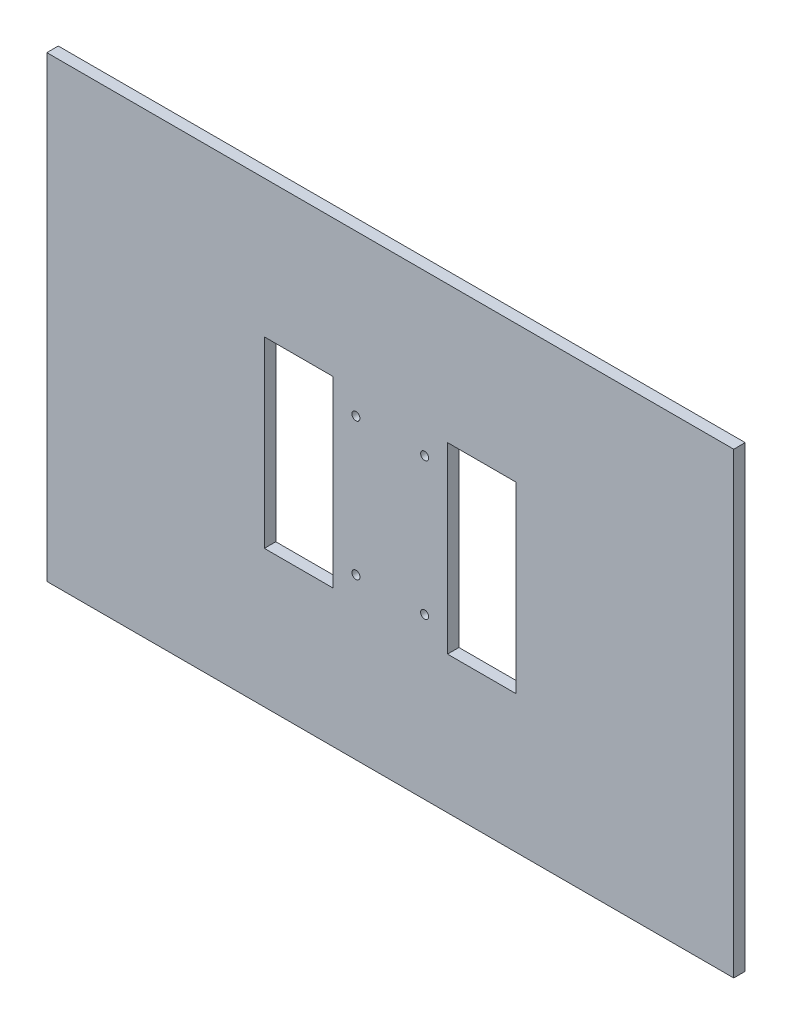
ISO-10303-21;
HEADER;
FILE_DESCRIPTION(('STEP AP214'),'2;1');
FILE_NAME('part.step','',(''),(''),'','','');
FILE_SCHEMA(('AUTOMOTIVE_DESIGN { 1 0 10303 214 1 1 1 1 }'));
ENDSEC;
DATA;
#1=APPLICATION_CONTEXT('core data for automotive mechanical design processes');
#2=APPLICATION_PROTOCOL_DEFINITION('international standard','automotive_design',2000,#1);
#3=PRODUCT_CONTEXT('',#1,'mechanical');
#4=PRODUCT('Part','Part','',(#3));
#5=PRODUCT_RELATED_PRODUCT_CATEGORY('part','',(#4));
#6=PRODUCT_DEFINITION_FORMATION('','',#4);
#7=PRODUCT_DEFINITION_CONTEXT('part definition',#1,'design');
#8=PRODUCT_DEFINITION('design','',#6,#7);
#9=PRODUCT_DEFINITION_SHAPE('','',#8);
#10=(LENGTH_UNIT() NAMED_UNIT(*) SI_UNIT(.MILLI.,.METRE.));
#11=(NAMED_UNIT(*) PLANE_ANGLE_UNIT() SI_UNIT($,.RADIAN.));
#12=(NAMED_UNIT(*) SI_UNIT($,.STERADIAN.) SOLID_ANGLE_UNIT());
#13=UNCERTAINTY_MEASURE_WITH_UNIT(LENGTH_MEASURE(1.E-05),#10,'distance_accuracy_value','');
#14=(GEOMETRIC_REPRESENTATION_CONTEXT(3) GLOBAL_UNCERTAINTY_ASSIGNED_CONTEXT((#13)) GLOBAL_UNIT_ASSIGNED_CONTEXT((#10,
#11,#12)) REPRESENTATION_CONTEXT('',''));
#15=CARTESIAN_POINT('',(0.,0.,0.));
#16=DIRECTION('',(0.,0.,1.));
#17=DIRECTION('',(1.,0.,0.));
#18=AXIS2_PLACEMENT_3D('',#15,#16,#17);
#19=CARTESIAN_POINT('',(150.,100.,5.));
#20=DIRECTION('',(-1.,0.,0.));
#21=DIRECTION('',(0.,-1.,0.));
#22=AXIS2_PLACEMENT_3D('',#19,#20,#21);
#23=PLANE('',#22);
#24=DIRECTION('',(0.,1.,0.));
#25=VECTOR('',#24,1.);
#26=CARTESIAN_POINT('',(150.,100.,0.));
#27=LINE('',#26,#25);
#28=CARTESIAN_POINT('',(150.,-100.,0.));
#29=VERTEX_POINT('',#28);
#30=CARTESIAN_POINT('',(150.,100.,0.));
#31=VERTEX_POINT('',#30);
#32=EDGE_CURVE('E210',#29,#31,#27,.T.);
#33=ORIENTED_EDGE('',*,*,#32,.T.);
#34=DIRECTION('',(0.,0.,-1.));
#35=VECTOR('',#34,1.);
#36=CARTESIAN_POINT('',(150.,100.,5.));
#37=LINE('',#36,#35);
#38=CARTESIAN_POINT('',(150.,100.,5.));
#39=VERTEX_POINT('',#38);
#40=EDGE_CURVE('E11',#39,#31,#37,.T.);
#41=ORIENTED_EDGE('',*,*,#40,.F.);
#42=DIRECTION('',(0.,1.,0.));
#43=VECTOR('',#42,1.);
#44=CARTESIAN_POINT('',(150.,100.,5.));
#45=LINE('',#44,#43);
#46=CARTESIAN_POINT('',(150.,-100.,5.));
#47=VERTEX_POINT('',#46);
#48=EDGE_CURVE('E213',#47,#39,#45,.T.);
#49=ORIENTED_EDGE('',*,*,#48,.F.);
#50=DIRECTION('',(0.,0.,-1.));
#51=VECTOR('',#50,1.);
#52=CARTESIAN_POINT('',(150.,-100.,5.));
#53=LINE('',#52,#51);
#54=EDGE_CURVE('E223',#47,#29,#53,.T.);
#55=ORIENTED_EDGE('',*,*,#54,.T.);
#56=EDGE_LOOP('',(#33,#41,#49,#55));
#57=FACE_BOUND('',#56,.T.);
#58=ADVANCED_FACE('F33',(#57),#23,.F.);
#59=CARTESIAN_POINT('',(-150.,100.,5.));
#60=DIRECTION('',(0.,-1.,0.));
#61=DIRECTION('',(0.,0.,-1.));
#62=AXIS2_PLACEMENT_3D('',#59,#60,#61);
#63=PLANE('',#62);
#64=DIRECTION('',(-1.,0.,0.));
#65=VECTOR('',#64,1.);
#66=CARTESIAN_POINT('',(-150.,100.,0.));
#67=LINE('',#66,#65);
#68=CARTESIAN_POINT('',(-150.,100.,0.));
#69=VERTEX_POINT('',#68);
#70=EDGE_CURVE('E226',#31,#69,#67,.T.);
#71=ORIENTED_EDGE('',*,*,#70,.T.);
#72=DIRECTION('',(0.,0.,-1.));
#73=VECTOR('',#72,1.);
#74=CARTESIAN_POINT('',(-150.,100.,5.));
#75=LINE('',#74,#73);
#76=CARTESIAN_POINT('',(-150.,100.,5.));
#77=VERTEX_POINT('',#76);
#78=EDGE_CURVE('E40',#77,#69,#75,.T.);
#79=ORIENTED_EDGE('',*,*,#78,.F.);
#80=DIRECTION('',(-1.,0.,0.));
#81=VECTOR('',#80,1.);
#82=CARTESIAN_POINT('',(-150.,100.,5.));
#83=LINE('',#82,#81);
#84=EDGE_CURVE('E216',#39,#77,#83,.T.);
#85=ORIENTED_EDGE('',*,*,#84,.F.);
#86=ORIENTED_EDGE('',*,*,#40,.T.);
#87=EDGE_LOOP('',(#71,#79,#85,#86));
#88=FACE_BOUND('',#87,.T.);
#89=ADVANCED_FACE('F255',(#88),#63,.F.);
#90=CARTESIAN_POINT('',(-150.,100.,5.));
#91=DIRECTION('',(1.,0.,0.));
#92=DIRECTION('',(0.,1.,0.));
#93=AXIS2_PLACEMENT_3D('',#90,#91,#92);
#94=PLANE('',#93);
#95=DIRECTION('',(0.,-1.,0.));
#96=VECTOR('',#95,1.);
#97=CARTESIAN_POINT('',(-150.,100.,0.));
#98=LINE('',#97,#96);
#99=CARTESIAN_POINT('',(-150.,-100.,0.));
#100=VERTEX_POINT('',#99);
#101=EDGE_CURVE('E228',#69,#100,#98,.T.);
#102=ORIENTED_EDGE('',*,*,#101,.T.);
#103=DIRECTION('',(0.,0.,-1.));
#104=VECTOR('',#103,1.);
#105=CARTESIAN_POINT('',(-150.,-100.,5.));
#106=LINE('',#105,#104);
#107=CARTESIAN_POINT('',(-150.,-100.,5.));
#108=VERTEX_POINT('',#107);
#109=EDGE_CURVE('E233',#108,#100,#106,.T.);
#110=ORIENTED_EDGE('',*,*,#109,.F.);
#111=DIRECTION('',(0.,-1.,0.));
#112=VECTOR('',#111,1.);
#113=CARTESIAN_POINT('',(-150.,100.,5.));
#114=LINE('',#113,#112);
#115=EDGE_CURVE('E219',#77,#108,#114,.T.);
#116=ORIENTED_EDGE('',*,*,#115,.F.);
#117=ORIENTED_EDGE('',*,*,#78,.T.);
#118=EDGE_LOOP('',(#102,#110,#116,#117));
#119=FACE_BOUND('',#118,.T.);
#120=ADVANCED_FACE('F240',(#119),#94,.F.);
#121=CARTESIAN_POINT('',(-150.,-100.,5.));
#122=DIRECTION('',(0.,1.,0.));
#123=DIRECTION('',(0.,0.,1.));
#124=AXIS2_PLACEMENT_3D('',#121,#122,#123);
#125=PLANE('',#124);
#126=DIRECTION('',(1.,0.,0.));
#127=VECTOR('',#126,1.);
#128=CARTESIAN_POINT('',(-150.,-100.,0.));
#129=LINE('',#128,#127);
#130=EDGE_CURVE('E217',#100,#29,#129,.T.);
#131=ORIENTED_EDGE('',*,*,#130,.T.);
#132=ORIENTED_EDGE('',*,*,#54,.F.);
#133=DIRECTION('',(1.,0.,0.));
#134=VECTOR('',#133,1.);
#135=CARTESIAN_POINT('',(-150.,-100.,5.));
#136=LINE('',#135,#134);
#137=EDGE_CURVE('E221',#108,#47,#136,.T.);
#138=ORIENTED_EDGE('',*,*,#137,.F.);
#139=ORIENTED_EDGE('',*,*,#109,.T.);
#140=EDGE_LOOP('',(#131,#132,#138,#139));
#141=FACE_BOUND('',#140,.T.);
#142=ADVANCED_FACE('F248',(#141),#125,.F.);
#143=CARTESIAN_POINT('',(0.,0.,5.));
#144=DIRECTION('',(0.,0.,1.));
#145=DIRECTION('',(1.,0.,0.));
#146=AXIS2_PLACEMENT_3D('',#143,#144,#145);
#147=PLANE('',#146);
#148=DIRECTION('',(0.,1.,0.));
#149=VECTOR('',#148,1.);
#150=CARTESIAN_POINT('',(55.,40.,5.));
#151=LINE('',#150,#149);
#152=CARTESIAN_POINT('',(55.,-40.,5.));
#153=VERTEX_POINT('',#152);
#154=CARTESIAN_POINT('',(55.,40.,5.));
#155=VERTEX_POINT('',#154);
#156=EDGE_CURVE('E47',#153,#155,#151,.T.);
#157=ORIENTED_EDGE('',*,*,#156,.F.);
#158=DIRECTION('',(1.,0.,0.));
#159=VECTOR('',#158,1.);
#160=CARTESIAN_POINT('',(55.,-40.,5.));
#161=LINE('',#160,#159);
#162=CARTESIAN_POINT('',(25.,-40.,5.));
#163=VERTEX_POINT('',#162);
#164=EDGE_CURVE('E182',#163,#153,#161,.T.);
#165=ORIENTED_EDGE('',*,*,#164,.F.);
#166=DIRECTION('',(0.,-1.,0.));
#167=VECTOR('',#166,1.);
#168=CARTESIAN_POINT('',(25.,40.,5.));
#169=LINE('',#168,#167);
#170=CARTESIAN_POINT('',(25.,40.,5.));
#171=VERTEX_POINT('',#170);
#172=EDGE_CURVE('E196',#171,#163,#169,.T.);
#173=ORIENTED_EDGE('',*,*,#172,.F.);
#174=DIRECTION('',(-1.,0.,0.));
#175=VECTOR('',#174,1.);
#176=CARTESIAN_POINT('',(55.,40.,5.));
#177=LINE('',#176,#175);
#178=EDGE_CURVE('E193',#155,#171,#177,.T.);
#179=ORIENTED_EDGE('',*,*,#178,.F.);
#180=EDGE_LOOP('',(#157,#165,#173,#179));
#181=FACE_BOUND('',#180,.T.);
#182=CARTESIAN_POINT('',(-15.,30.,5.));
#183=DIRECTION('',(0.,0.,1.));
#184=DIRECTION('',(1.,0.,0.));
#185=AXIS2_PLACEMENT_3D('',#182,#183,#184);
#186=CIRCLE('',#185,1.75);
#187=CARTESIAN_POINT('',(-13.25,30.,5.));
#188=VERTEX_POINT('',#187);
#189=EDGE_CURVE('E168',#188,#188,#186,.T.);
#190=ORIENTED_EDGE('',*,*,#189,.F.);
#191=EDGE_LOOP('',(#190));
#192=FACE_BOUND('',#191,.T.);
#193=CARTESIAN_POINT('',(-15.,-30.,5.));
#194=DIRECTION('',(0.,0.,1.));
#195=DIRECTION('',(1.,0.,0.));
#196=AXIS2_PLACEMENT_3D('',#193,#194,#195);
#197=CIRCLE('',#196,1.75);
#198=CARTESIAN_POINT('',(-13.25,-30.,5.));
#199=VERTEX_POINT('',#198);
#200=EDGE_CURVE('E174',#199,#199,#197,.T.);
#201=ORIENTED_EDGE('',*,*,#200,.F.);
#202=EDGE_LOOP('',(#201));
#203=FACE_BOUND('',#202,.T.);
#204=CARTESIAN_POINT('',(15.,-30.,5.));
#205=DIRECTION('',(0.,0.,1.));
#206=DIRECTION('',(1.,0.,0.));
#207=AXIS2_PLACEMENT_3D('',#204,#205,#206);
#208=CIRCLE('',#207,1.75);
#209=CARTESIAN_POINT('',(16.75,-30.,5.));
#210=VERTEX_POINT('',#209);
#211=EDGE_CURVE('E148',#210,#210,#208,.T.);
#212=ORIENTED_EDGE('',*,*,#211,.F.);
#213=EDGE_LOOP('',(#212));
#214=FACE_BOUND('',#213,.T.);
#215=DIRECTION('',(0.,1.,0.));
#216=VECTOR('',#215,1.);
#217=CARTESIAN_POINT('',(-25.,40.,5.));
#218=LINE('',#217,#216);
#219=CARTESIAN_POINT('',(-25.,-40.,5.));
#220=VERTEX_POINT('',#219);
#221=CARTESIAN_POINT('',(-25.,40.,5.));
#222=VERTEX_POINT('',#221);
#223=EDGE_CURVE('E55',#220,#222,#218,.T.);
#224=ORIENTED_EDGE('',*,*,#223,.F.);
#225=DIRECTION('',(1.,0.,0.));
#226=VECTOR('',#225,1.);
#227=CARTESIAN_POINT('',(-55.,-40.,5.));
#228=LINE('',#227,#226);
#229=CARTESIAN_POINT('',(-55.,-40.,5.));
#230=VERTEX_POINT('',#229);
#231=EDGE_CURVE('E142',#230,#220,#228,.T.);
#232=ORIENTED_EDGE('',*,*,#231,.F.);
#233=DIRECTION('',(0.,-1.,0.));
#234=VECTOR('',#233,1.);
#235=CARTESIAN_POINT('',(-55.,40.,5.));
#236=LINE('',#235,#234);
#237=CARTESIAN_POINT('',(-55.,40.,5.));
#238=VERTEX_POINT('',#237);
#239=EDGE_CURVE('E145',#238,#230,#236,.T.);
#240=ORIENTED_EDGE('',*,*,#239,.F.);
#241=DIRECTION('',(-1.,0.,0.));
#242=VECTOR('',#241,1.);
#243=CARTESIAN_POINT('',(-55.,40.,5.));
#244=LINE('',#243,#242);
#245=EDGE_CURVE('E154',#222,#238,#244,.T.);
#246=ORIENTED_EDGE('',*,*,#245,.F.);
#247=EDGE_LOOP('',(#224,#232,#240,#246));
#248=FACE_BOUND('',#247,.T.);
#249=CARTESIAN_POINT('',(15.,30.,5.));
#250=DIRECTION('',(0.,0.,1.));
#251=DIRECTION('',(1.,0.,0.));
#252=AXIS2_PLACEMENT_3D('',#249,#250,#251);
#253=CIRCLE('',#252,1.75);
#254=CARTESIAN_POINT('',(16.75,30.,5.));
#255=VERTEX_POINT('',#254);
#256=EDGE_CURVE('E167',#255,#255,#253,.T.);
#257=ORIENTED_EDGE('',*,*,#256,.F.);
#258=EDGE_LOOP('',(#257));
#259=FACE_BOUND('',#258,.T.);
#260=ORIENTED_EDGE('',*,*,#48,.T.);
#261=ORIENTED_EDGE('',*,*,#84,.T.);
#262=ORIENTED_EDGE('',*,*,#115,.T.);
#263=ORIENTED_EDGE('',*,*,#137,.T.);
#264=EDGE_LOOP('',(#260,#261,#262,#263));
#265=FACE_BOUND('',#264,.T.);
#266=ADVANCED_FACE('F254',(#181,#192,#203,#214,#248,#259,#265),#147,.T.);
#267=CARTESIAN_POINT('',(0.,0.,0.));
#268=DIRECTION('',(0.,0.,1.));
#269=DIRECTION('',(1.,0.,0.));
#270=AXIS2_PLACEMENT_3D('',#267,#268,#269);
#271=PLANE('',#270);
#272=DIRECTION('',(1.,0.,0.));
#273=VECTOR('',#272,1.);
#274=CARTESIAN_POINT('',(55.,-40.,0.));
#275=LINE('',#274,#273);
#276=CARTESIAN_POINT('',(25.,-40.,0.));
#277=VERTEX_POINT('',#276);
#278=CARTESIAN_POINT('',(55.,-40.,0.));
#279=VERTEX_POINT('',#278);
#280=EDGE_CURVE('E188',#277,#279,#275,.T.);
#281=ORIENTED_EDGE('',*,*,#280,.T.);
#282=DIRECTION('',(0.,1.,0.));
#283=VECTOR('',#282,1.);
#284=CARTESIAN_POINT('',(55.,40.,0.));
#285=LINE('',#284,#283);
#286=CARTESIAN_POINT('',(55.,40.,0.));
#287=VERTEX_POINT('',#286);
#288=EDGE_CURVE('E178',#279,#287,#285,.T.);
#289=ORIENTED_EDGE('',*,*,#288,.T.);
#290=DIRECTION('',(-1.,0.,0.));
#291=VECTOR('',#290,1.);
#292=CARTESIAN_POINT('',(55.,40.,0.));
#293=LINE('',#292,#291);
#294=CARTESIAN_POINT('',(25.,40.,0.));
#295=VERTEX_POINT('',#294);
#296=EDGE_CURVE('E181',#287,#295,#293,.T.);
#297=ORIENTED_EDGE('',*,*,#296,.T.);
#298=DIRECTION('',(0.,-1.,0.));
#299=VECTOR('',#298,1.);
#300=CARTESIAN_POINT('',(25.,40.,0.));
#301=LINE('',#300,#299);
#302=EDGE_CURVE('E185',#295,#277,#301,.T.);
#303=ORIENTED_EDGE('',*,*,#302,.T.);
#304=EDGE_LOOP('',(#281,#289,#297,#303));
#305=FACE_BOUND('',#304,.T.);
#306=CARTESIAN_POINT('',(-15.,30.,0.));
#307=DIRECTION('',(0.,0.,1.));
#308=DIRECTION('',(1.,0.,0.));
#309=AXIS2_PLACEMENT_3D('',#306,#307,#308);
#310=CIRCLE('',#309,1.75);
#311=CARTESIAN_POINT('',(-13.25,30.,0.));
#312=VERTEX_POINT('',#311);
#313=EDGE_CURVE('E164',#312,#312,#310,.T.);
#314=ORIENTED_EDGE('',*,*,#313,.T.);
#315=EDGE_LOOP('',(#314));
#316=FACE_BOUND('',#315,.T.);
#317=CARTESIAN_POINT('',(-15.,-30.,0.));
#318=DIRECTION('',(0.,0.,1.));
#319=DIRECTION('',(1.,0.,0.));
#320=AXIS2_PLACEMENT_3D('',#317,#318,#319);
#321=CIRCLE('',#320,1.75);
#322=CARTESIAN_POINT('',(-13.25,-30.,0.));
#323=VERTEX_POINT('',#322);
#324=EDGE_CURVE('E171',#323,#323,#321,.T.);
#325=ORIENTED_EDGE('',*,*,#324,.T.);
#326=EDGE_LOOP('',(#325));
#327=FACE_BOUND('',#326,.T.);
#328=CARTESIAN_POINT('',(15.,-30.,0.));
#329=DIRECTION('',(0.,0.,1.));
#330=DIRECTION('',(1.,0.,0.));
#331=AXIS2_PLACEMENT_3D('',#328,#329,#330);
#332=CIRCLE('',#331,1.75);
#333=CARTESIAN_POINT('',(16.75,-30.,0.));
#334=VERTEX_POINT('',#333);
#335=EDGE_CURVE('E177',#334,#334,#332,.T.);
#336=ORIENTED_EDGE('',*,*,#335,.T.);
#337=EDGE_LOOP('',(#336));
#338=FACE_BOUND('',#337,.T.);
#339=DIRECTION('',(1.,0.,0.));
#340=VECTOR('',#339,1.);
#341=CARTESIAN_POINT('',(-55.,-40.,0.));
#342=LINE('',#341,#340);
#343=CARTESIAN_POINT('',(-55.,-40.,0.));
#344=VERTEX_POINT('',#343);
#345=CARTESIAN_POINT('',(-25.,-40.,0.));
#346=VERTEX_POINT('',#345);
#347=EDGE_CURVE('E129',#344,#346,#342,.T.);
#348=ORIENTED_EDGE('',*,*,#347,.T.);
#349=DIRECTION('',(0.,1.,0.));
#350=VECTOR('',#349,1.);
#351=CARTESIAN_POINT('',(-25.,40.,0.));
#352=LINE('',#351,#350);
#353=CARTESIAN_POINT('',(-25.,40.,0.));
#354=VERTEX_POINT('',#353);
#355=EDGE_CURVE('E123',#346,#354,#352,.T.);
#356=ORIENTED_EDGE('',*,*,#355,.T.);
#357=DIRECTION('',(-1.,0.,0.));
#358=VECTOR('',#357,1.);
#359=CARTESIAN_POINT('',(-55.,40.,0.));
#360=LINE('',#359,#358);
#361=CARTESIAN_POINT('',(-55.,40.,0.));
#362=VERTEX_POINT('',#361);
#363=EDGE_CURVE('E133',#354,#362,#360,.T.);
#364=ORIENTED_EDGE('',*,*,#363,.T.);
#365=DIRECTION('',(0.,-1.,0.));
#366=VECTOR('',#365,1.);
#367=CARTESIAN_POINT('',(-55.,40.,0.));
#368=LINE('',#367,#366);
#369=EDGE_CURVE('E137',#362,#344,#368,.T.);
#370=ORIENTED_EDGE('',*,*,#369,.T.);
#371=EDGE_LOOP('',(#348,#356,#364,#370));
#372=FACE_BOUND('',#371,.T.);
#373=CARTESIAN_POINT('',(15.,30.,0.));
#374=DIRECTION('',(0.,0.,1.));
#375=DIRECTION('',(1.,0.,0.));
#376=AXIS2_PLACEMENT_3D('',#373,#374,#375);
#377=CIRCLE('',#376,1.75);
#378=CARTESIAN_POINT('',(16.75,30.,0.));
#379=VERTEX_POINT('',#378);
#380=EDGE_CURVE('E207',#379,#379,#377,.T.);
#381=ORIENTED_EDGE('',*,*,#380,.T.);
#382=EDGE_LOOP('',(#381));
#383=FACE_BOUND('',#382,.T.);
#384=ORIENTED_EDGE('',*,*,#32,.F.);
#385=ORIENTED_EDGE('',*,*,#130,.F.);
#386=ORIENTED_EDGE('',*,*,#101,.F.);
#387=ORIENTED_EDGE('',*,*,#70,.F.);
#388=EDGE_LOOP('',(#384,#385,#386,#387));
#389=FACE_BOUND('',#388,.T.);
#390=ADVANCED_FACE('F139',(#305,#316,#327,#338,#372,#383,#389),#271,.F.);
#391=CARTESIAN_POINT('',(15.,30.,0.));
#392=DIRECTION('',(0.,0.,1.));
#393=DIRECTION('',(1.,0.,0.));
#394=AXIS2_PLACEMENT_3D('',#391,#392,#393);
#395=CYLINDRICAL_SURFACE('',#394,1.75);
#396=ORIENTED_EDGE('',*,*,#380,.F.);
#397=EDGE_LOOP('',(#396));
#398=FACE_BOUND('',#397,.T.);
#399=ORIENTED_EDGE('',*,*,#256,.T.);
#400=EDGE_LOOP('',(#399));
#401=FACE_BOUND('',#400,.T.);
#402=ADVANCED_FACE('F267',(#398,#401),#395,.F.);
#403=CARTESIAN_POINT('',(-25.,40.,0.));
#404=DIRECTION('',(1.,0.,0.));
#405=DIRECTION('',(0.,1.,0.));
#406=AXIS2_PLACEMENT_3D('',#403,#404,#405);
#407=PLANE('',#406);
#408=ORIENTED_EDGE('',*,*,#223,.T.);
#409=DIRECTION('',(0.,0.,1.));
#410=VECTOR('',#409,1.);
#411=CARTESIAN_POINT('',(-25.,40.,0.));
#412=LINE('',#411,#410);
#413=EDGE_CURVE('E119',#354,#222,#412,.T.);
#414=ORIENTED_EDGE('',*,*,#413,.F.);
#415=ORIENTED_EDGE('',*,*,#355,.F.);
#416=DIRECTION('',(0.,0.,1.));
#417=VECTOR('',#416,1.);
#418=CARTESIAN_POINT('',(-25.,-40.,0.));
#419=LINE('',#418,#417);
#420=EDGE_CURVE('E159',#346,#220,#419,.T.);
#421=ORIENTED_EDGE('',*,*,#420,.T.);
#422=EDGE_LOOP('',(#408,#414,#415,#421));
#423=FACE_BOUND('',#422,.T.);
#424=ADVANCED_FACE('F121',(#423),#407,.F.);
#425=CARTESIAN_POINT('',(-55.,-40.,0.));
#426=DIRECTION('',(0.,-1.,0.));
#427=DIRECTION('',(0.,0.,-1.));
#428=AXIS2_PLACEMENT_3D('',#425,#426,#427);
#429=PLANE('',#428);
#430=ORIENTED_EDGE('',*,*,#231,.T.);
#431=ORIENTED_EDGE('',*,*,#420,.F.);
#432=ORIENTED_EDGE('',*,*,#347,.F.);
#433=DIRECTION('',(0.,0.,1.));
#434=VECTOR('',#433,1.);
#435=CARTESIAN_POINT('',(-55.,-40.,0.));
#436=LINE('',#435,#434);
#437=EDGE_CURVE('E161',#344,#230,#436,.T.);
#438=ORIENTED_EDGE('',*,*,#437,.T.);
#439=EDGE_LOOP('',(#430,#431,#432,#438));
#440=FACE_BOUND('',#439,.T.);
#441=ADVANCED_FACE('F301',(#440),#429,.F.);
#442=CARTESIAN_POINT('',(-55.,40.,0.));
#443=DIRECTION('',(-1.,0.,0.));
#444=DIRECTION('',(0.,-1.,0.));
#445=AXIS2_PLACEMENT_3D('',#442,#443,#444);
#446=PLANE('',#445);
#447=ORIENTED_EDGE('',*,*,#239,.T.);
#448=ORIENTED_EDGE('',*,*,#437,.F.);
#449=ORIENTED_EDGE('',*,*,#369,.F.);
#450=DIRECTION('',(0.,0.,1.));
#451=VECTOR('',#450,1.);
#452=CARTESIAN_POINT('',(-55.,40.,0.));
#453=LINE('',#452,#451);
#454=EDGE_CURVE('E128',#362,#238,#453,.T.);
#455=ORIENTED_EDGE('',*,*,#454,.T.);
#456=EDGE_LOOP('',(#447,#448,#449,#455));
#457=FACE_BOUND('',#456,.T.);
#458=ADVANCED_FACE('F304',(#457),#446,.F.);
#459=CARTESIAN_POINT('',(-55.,40.,0.));
#460=DIRECTION('',(0.,1.,0.));
#461=DIRECTION('',(0.,0.,1.));
#462=AXIS2_PLACEMENT_3D('',#459,#460,#461);
#463=PLANE('',#462);
#464=ORIENTED_EDGE('',*,*,#245,.T.);
#465=ORIENTED_EDGE('',*,*,#454,.F.);
#466=ORIENTED_EDGE('',*,*,#363,.F.);
#467=ORIENTED_EDGE('',*,*,#413,.T.);
#468=EDGE_LOOP('',(#464,#465,#466,#467));
#469=FACE_BOUND('',#468,.T.);
#470=ADVANCED_FACE('F134',(#469),#463,.F.);
#471=CARTESIAN_POINT('',(15.,-30.,0.));
#472=DIRECTION('',(0.,0.,1.));
#473=DIRECTION('',(1.,0.,0.));
#474=AXIS2_PLACEMENT_3D('',#471,#472,#473);
#475=CYLINDRICAL_SURFACE('',#474,1.75);
#476=ORIENTED_EDGE('',*,*,#335,.F.);
#477=EDGE_LOOP('',(#476));
#478=FACE_BOUND('',#477,.T.);
#479=ORIENTED_EDGE('',*,*,#211,.T.);
#480=EDGE_LOOP('',(#479));
#481=FACE_BOUND('',#480,.T.);
#482=ADVANCED_FACE('F294',(#478,#481),#475,.F.);
#483=CARTESIAN_POINT('',(-15.,-30.,0.));
#484=DIRECTION('',(0.,0.,1.));
#485=DIRECTION('',(1.,0.,0.));
#486=AXIS2_PLACEMENT_3D('',#483,#484,#485);
#487=CYLINDRICAL_SURFACE('',#486,1.75);
#488=ORIENTED_EDGE('',*,*,#324,.F.);
#489=EDGE_LOOP('',(#488));
#490=FACE_BOUND('',#489,.T.);
#491=ORIENTED_EDGE('',*,*,#200,.T.);
#492=EDGE_LOOP('',(#491));
#493=FACE_BOUND('',#492,.T.);
#494=ADVANCED_FACE('F291',(#490,#493),#487,.F.);
#495=CARTESIAN_POINT('',(-15.,30.,0.));
#496=DIRECTION('',(0.,0.,1.));
#497=DIRECTION('',(1.,0.,0.));
#498=AXIS2_PLACEMENT_3D('',#495,#496,#497);
#499=CYLINDRICAL_SURFACE('',#498,1.75);
#500=ORIENTED_EDGE('',*,*,#313,.F.);
#501=EDGE_LOOP('',(#500));
#502=FACE_BOUND('',#501,.T.);
#503=ORIENTED_EDGE('',*,*,#189,.T.);
#504=EDGE_LOOP('',(#503));
#505=FACE_BOUND('',#504,.T.);
#506=ADVANCED_FACE('F279',(#502,#505),#499,.F.);
#507=CARTESIAN_POINT('',(55.,40.,0.));
#508=DIRECTION('',(1.,0.,0.));
#509=DIRECTION('',(0.,1.,0.));
#510=AXIS2_PLACEMENT_3D('',#507,#508,#509);
#511=PLANE('',#510);
#512=ORIENTED_EDGE('',*,*,#156,.T.);
#513=DIRECTION('',(0.,0.,1.));
#514=VECTOR('',#513,1.);
#515=CARTESIAN_POINT('',(55.,40.,0.));
#516=LINE('',#515,#514);
#517=EDGE_CURVE('E191',#287,#155,#516,.T.);
#518=ORIENTED_EDGE('',*,*,#517,.F.);
#519=ORIENTED_EDGE('',*,*,#288,.F.);
#520=DIRECTION('',(0.,0.,1.));
#521=VECTOR('',#520,1.);
#522=CARTESIAN_POINT('',(55.,-40.,0.));
#523=LINE('',#522,#521);
#524=EDGE_CURVE('E155',#279,#153,#523,.T.);
#525=ORIENTED_EDGE('',*,*,#524,.T.);
#526=EDGE_LOOP('',(#512,#518,#519,#525));
#527=FACE_BOUND('',#526,.T.);
#528=ADVANCED_FACE('F275',(#527),#511,.F.);
#529=CARTESIAN_POINT('',(55.,-40.,0.));
#530=DIRECTION('',(0.,-1.,0.));
#531=DIRECTION('',(0.,0.,-1.));
#532=AXIS2_PLACEMENT_3D('',#529,#530,#531);
#533=PLANE('',#532);
#534=ORIENTED_EDGE('',*,*,#164,.T.);
#535=ORIENTED_EDGE('',*,*,#524,.F.);
#536=ORIENTED_EDGE('',*,*,#280,.F.);
#537=DIRECTION('',(0.,0.,1.));
#538=VECTOR('',#537,1.);
#539=CARTESIAN_POINT('',(25.,-40.,0.));
#540=LINE('',#539,#538);
#541=EDGE_CURVE('E202',#277,#163,#540,.T.);
#542=ORIENTED_EDGE('',*,*,#541,.T.);
#543=EDGE_LOOP('',(#534,#535,#536,#542));
#544=FACE_BOUND('',#543,.T.);
#545=ADVANCED_FACE('F278',(#544),#533,.F.);
#546=CARTESIAN_POINT('',(25.,40.,0.));
#547=DIRECTION('',(-1.,0.,0.));
#548=DIRECTION('',(0.,-1.,0.));
#549=AXIS2_PLACEMENT_3D('',#546,#547,#548);
#550=PLANE('',#549);
#551=ORIENTED_EDGE('',*,*,#172,.T.);
#552=ORIENTED_EDGE('',*,*,#541,.F.);
#553=ORIENTED_EDGE('',*,*,#302,.F.);
#554=DIRECTION('',(0.,0.,1.));
#555=VECTOR('',#554,1.);
#556=CARTESIAN_POINT('',(25.,40.,0.));
#557=LINE('',#556,#555);
#558=EDGE_CURVE('E204',#295,#171,#557,.T.);
#559=ORIENTED_EDGE('',*,*,#558,.T.);
#560=EDGE_LOOP('',(#551,#552,#553,#559));
#561=FACE_BOUND('',#560,.T.);
#562=ADVANCED_FACE('F283',(#561),#550,.F.);
#563=CARTESIAN_POINT('',(55.,40.,0.));
#564=DIRECTION('',(0.,1.,0.));
#565=DIRECTION('',(0.,0.,1.));
#566=AXIS2_PLACEMENT_3D('',#563,#564,#565);
#567=PLANE('',#566);
#568=ORIENTED_EDGE('',*,*,#178,.T.);
#569=ORIENTED_EDGE('',*,*,#558,.F.);
#570=ORIENTED_EDGE('',*,*,#296,.F.);
#571=ORIENTED_EDGE('',*,*,#517,.T.);
#572=EDGE_LOOP('',(#568,#569,#570,#571));
#573=FACE_BOUND('',#572,.T.);
#574=ADVANCED_FACE('F280',(#573),#567,.F.);
#575=CLOSED_SHELL('',(#58,#89,#120,#142,#266,#390,#402,#424,#441,#458,#470,#482,#494,#506,#528,
#545,#562,#574));
#576=MANIFOLD_SOLID_BREP('B2',#575);
#577=ADVANCED_BREP_SHAPE_REPRESENTATION('',(#18,#576),#14);
#578=SHAPE_DEFINITION_REPRESENTATION(#9,#577);
ENDSEC;
END-ISO-10303-21;
